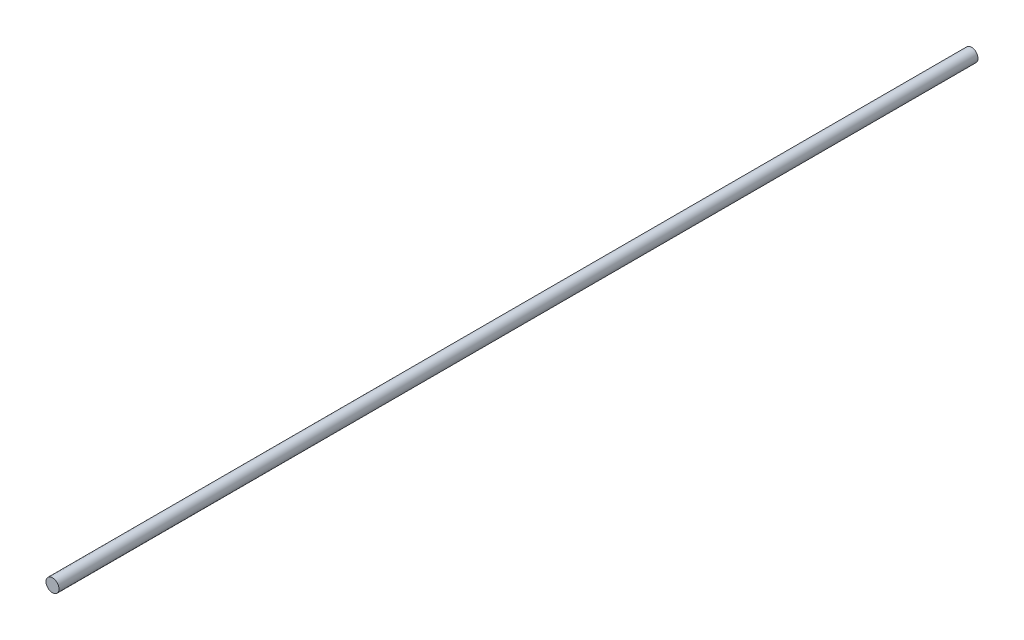
ISO-10303-21;
HEADER;
FILE_DESCRIPTION(('STEP AP214'),'2;1');
FILE_NAME('part.step','',(''),(''),'','','');
FILE_SCHEMA(('AUTOMOTIVE_DESIGN { 1 0 10303 214 1 1 1 1 }'));
ENDSEC;
DATA;
#1=APPLICATION_CONTEXT('core data for automotive mechanical design processes');
#2=APPLICATION_PROTOCOL_DEFINITION('international standard','automotive_design',2000,#1);
#3=PRODUCT_CONTEXT('',#1,'mechanical');
#4=PRODUCT('Part','Part','',(#3));
#5=PRODUCT_RELATED_PRODUCT_CATEGORY('part','',(#4));
#6=PRODUCT_DEFINITION_FORMATION('','',#4);
#7=PRODUCT_DEFINITION_CONTEXT('part definition',#1,'design');
#8=PRODUCT_DEFINITION('design','',#6,#7);
#9=PRODUCT_DEFINITION_SHAPE('','',#8);
#10=(LENGTH_UNIT() NAMED_UNIT(*) SI_UNIT(.MILLI.,.METRE.));
#11=(NAMED_UNIT(*) PLANE_ANGLE_UNIT() SI_UNIT($,.RADIAN.));
#12=(NAMED_UNIT(*) SI_UNIT($,.STERADIAN.) SOLID_ANGLE_UNIT());
#13=UNCERTAINTY_MEASURE_WITH_UNIT(LENGTH_MEASURE(1.E-05),#10,'distance_accuracy_value','');
#14=(GEOMETRIC_REPRESENTATION_CONTEXT(3) GLOBAL_UNCERTAINTY_ASSIGNED_CONTEXT((#13)) GLOBAL_UNIT_ASSIGNED_CONTEXT((#10,
#11,#12)) REPRESENTATION_CONTEXT('',''));
#15=CARTESIAN_POINT('',(0.,0.,0.));
#16=DIRECTION('',(0.,0.,1.));
#17=DIRECTION('',(1.,0.,0.));
#18=AXIS2_PLACEMENT_3D('',#15,#16,#17);
#19=CARTESIAN_POINT('',(0.,0.,565.));
#20=DIRECTION('',(0.,0.,-1.));
#21=DIRECTION('',(-1.,0.,0.));
#22=AXIS2_PLACEMENT_3D('',#19,#20,#21);
#23=CYLINDRICAL_SURFACE('',#22,4.);
#24=CARTESIAN_POINT('',(0.,0.,565.));
#25=DIRECTION('',(0.,0.,1.));
#26=DIRECTION('',(1.,0.,0.));
#27=AXIS2_PLACEMENT_3D('',#24,#25,#26);
#28=CIRCLE('',#27,4.);
#29=CARTESIAN_POINT('',(4.,0.,565.));
#30=VERTEX_POINT('',#29);
#31=EDGE_CURVE('E10',#30,#30,#28,.T.);
#32=ORIENTED_EDGE('',*,*,#31,.F.);
#33=EDGE_LOOP('',(#32));
#34=FACE_BOUND('',#33,.T.);
#35=CARTESIAN_POINT('',(0.,0.,0.));
#36=DIRECTION('',(0.,0.,1.));
#37=DIRECTION('',(1.,0.,0.));
#38=AXIS2_PLACEMENT_3D('',#35,#36,#37);
#39=CIRCLE('',#38,4.);
#40=CARTESIAN_POINT('',(4.,0.,0.));
#41=VERTEX_POINT('',#40);
#42=EDGE_CURVE('E34',#41,#41,#39,.T.);
#43=ORIENTED_EDGE('',*,*,#42,.T.);
#44=EDGE_LOOP('',(#43));
#45=FACE_BOUND('',#44,.T.);
#46=ADVANCED_FACE('F31',(#34,#45),#23,.T.);
#47=CARTESIAN_POINT('',(0.,0.,565.));
#48=DIRECTION('',(0.,0.,1.));
#49=DIRECTION('',(1.,0.,0.));
#50=AXIS2_PLACEMENT_3D('',#47,#48,#49);
#51=PLANE('',#50);
#52=ORIENTED_EDGE('',*,*,#31,.T.);
#53=EDGE_LOOP('',(#52));
#54=FACE_BOUND('',#53,.T.);
#55=ADVANCED_FACE('F46',(#54),#51,.T.);
#56=CARTESIAN_POINT('',(0.,0.,0.));
#57=DIRECTION('',(0.,0.,1.));
#58=DIRECTION('',(1.,0.,0.));
#59=AXIS2_PLACEMENT_3D('',#56,#57,#58);
#60=PLANE('',#59);
#61=ORIENTED_EDGE('',*,*,#42,.F.);
#62=EDGE_LOOP('',(#61));
#63=FACE_BOUND('',#62,.T.);
#64=ADVANCED_FACE('F44',(#63),#60,.F.);
#65=CLOSED_SHELL('',(#46,#55,#64));
#66=MANIFOLD_SOLID_BREP('B2',#65);
#67=ADVANCED_BREP_SHAPE_REPRESENTATION('',(#18,#66),#14);
#68=SHAPE_DEFINITION_REPRESENTATION(#9,#67);
ENDSEC;
END-ISO-10303-21;
